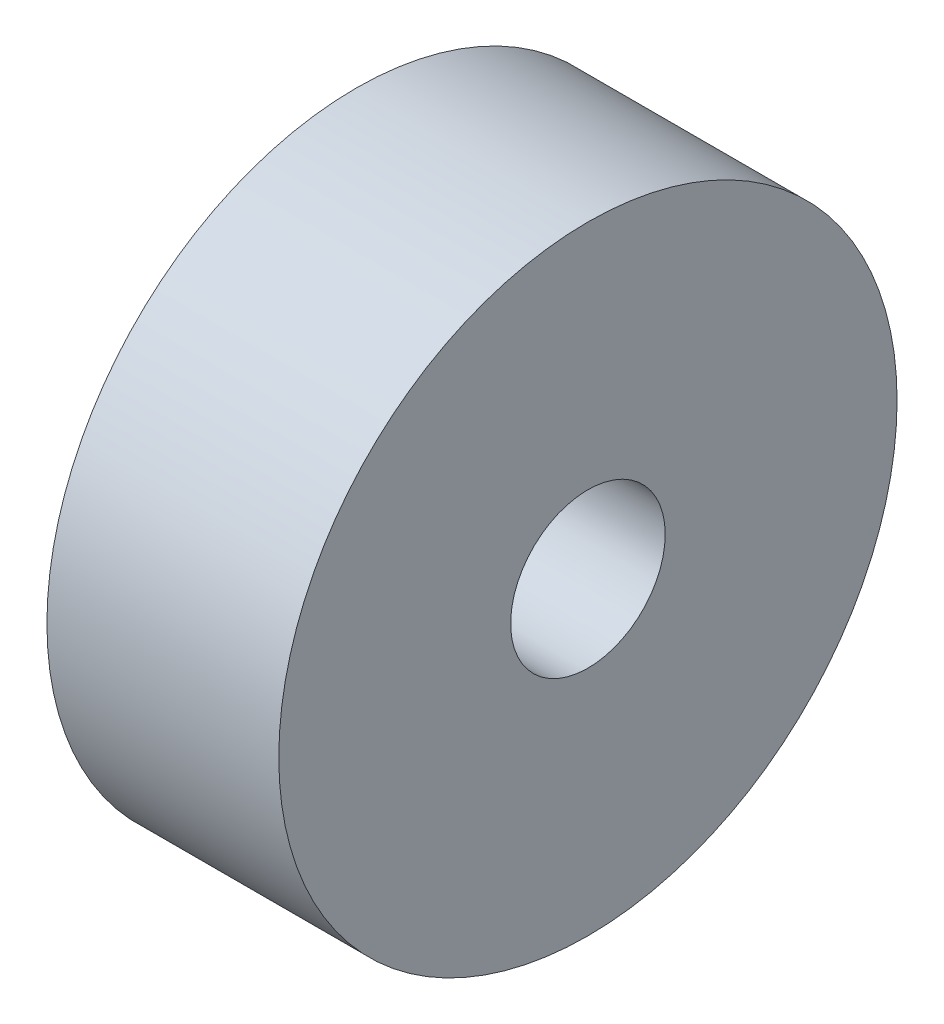
ISO-10303-21;
HEADER;
FILE_DESCRIPTION(('STEP AP214'),'2;1');
FILE_NAME('part.step','',(''),(''),'','','');
FILE_SCHEMA(('AUTOMOTIVE_DESIGN { 1 0 10303 214 1 1 1 1 }'));
ENDSEC;
DATA;
#1=APPLICATION_CONTEXT('core data for automotive mechanical design processes');
#2=APPLICATION_PROTOCOL_DEFINITION('international standard','automotive_design',2000,#1);
#3=PRODUCT_CONTEXT('',#1,'mechanical');
#4=PRODUCT('Part','Part','',(#3));
#5=PRODUCT_RELATED_PRODUCT_CATEGORY('part','',(#4));
#6=PRODUCT_DEFINITION_FORMATION('','',#4);
#7=PRODUCT_DEFINITION_CONTEXT('part definition',#1,'design');
#8=PRODUCT_DEFINITION('design','',#6,#7);
#9=PRODUCT_DEFINITION_SHAPE('','',#8);
#10=(LENGTH_UNIT() NAMED_UNIT(*) SI_UNIT(.MILLI.,.METRE.));
#11=(NAMED_UNIT(*) PLANE_ANGLE_UNIT() SI_UNIT($,.RADIAN.));
#12=(NAMED_UNIT(*) SI_UNIT($,.STERADIAN.) SOLID_ANGLE_UNIT());
#13=UNCERTAINTY_MEASURE_WITH_UNIT(LENGTH_MEASURE(1.E-05),#10,'distance_accuracy_value','');
#14=(GEOMETRIC_REPRESENTATION_CONTEXT(3) GLOBAL_UNCERTAINTY_ASSIGNED_CONTEXT((#13)) GLOBAL_UNIT_ASSIGNED_CONTEXT((#10,
#11,#12)) REPRESENTATION_CONTEXT('',''));
#15=CARTESIAN_POINT('',(0.,0.,0.));
#16=DIRECTION('',(0.,0.,1.));
#17=DIRECTION('',(1.,0.,0.));
#18=AXIS2_PLACEMENT_3D('',#15,#16,#17);
#19=CARTESIAN_POINT('',(76.2,0.,0.));
#20=DIRECTION('',(1.,0.,0.));
#21=DIRECTION('',(0.,0.,-1.));
#22=AXIS2_PLACEMENT_3D('',#19,#20,#21);
#23=PLANE('',#22);
#24=CARTESIAN_POINT('',(76.2,0.,0.));
#25=DIRECTION('',(1.,0.,0.));
#26=DIRECTION('',(0.,0.,-1.));
#27=AXIS2_PLACEMENT_3D('',#24,#25,#26);
#28=CIRCLE('',#27,101.6);
#29=CARTESIAN_POINT('',(76.2,0.,-101.6));
#30=VERTEX_POINT('',#29);
#31=EDGE_CURVE('E10',#30,#30,#28,.T.);
#32=ORIENTED_EDGE('',*,*,#31,.T.);
#33=EDGE_LOOP('',(#32));
#34=FACE_BOUND('',#33,.T.);
#35=CARTESIAN_POINT('',(76.2,0.,0.));
#36=DIRECTION('',(1.,0.,0.));
#37=DIRECTION('',(0.,0.,-1.));
#38=AXIS2_PLACEMENT_3D('',#35,#36,#37);
#39=CIRCLE('',#38,25.4);
#40=CARTESIAN_POINT('',(76.2,0.,-25.4));
#41=VERTEX_POINT('',#40);
#42=EDGE_CURVE('E42',#41,#41,#39,.T.);
#43=ORIENTED_EDGE('',*,*,#42,.F.);
#44=EDGE_LOOP('',(#43));
#45=FACE_BOUND('',#44,.T.);
#46=ADVANCED_FACE('F31',(#34,#45),#23,.T.);
#47=CARTESIAN_POINT('',(0.,0.,0.));
#48=DIRECTION('',(1.,0.,0.));
#49=DIRECTION('',(0.,0.,-1.));
#50=AXIS2_PLACEMENT_3D('',#47,#48,#49);
#51=PLANE('',#50);
#52=CARTESIAN_POINT('',(0.,0.,0.));
#53=DIRECTION('',(1.,0.,0.));
#54=DIRECTION('',(0.,0.,-1.));
#55=AXIS2_PLACEMENT_3D('',#52,#53,#54);
#56=CIRCLE('',#55,101.6);
#57=CARTESIAN_POINT('',(0.,0.,-101.6));
#58=VERTEX_POINT('',#57);
#59=EDGE_CURVE('E35',#58,#58,#56,.T.);
#60=ORIENTED_EDGE('',*,*,#59,.F.);
#61=EDGE_LOOP('',(#60));
#62=FACE_BOUND('',#61,.T.);
#63=CARTESIAN_POINT('',(0.,0.,0.));
#64=DIRECTION('',(1.,0.,0.));
#65=DIRECTION('',(0.,0.,-1.));
#66=AXIS2_PLACEMENT_3D('',#63,#64,#65);
#67=CIRCLE('',#66,25.4);
#68=CARTESIAN_POINT('',(0.,0.,-25.4));
#69=VERTEX_POINT('',#68);
#70=EDGE_CURVE('E44',#69,#69,#67,.T.);
#71=ORIENTED_EDGE('',*,*,#70,.T.);
#72=EDGE_LOOP('',(#71));
#73=FACE_BOUND('',#72,.T.);
#74=ADVANCED_FACE('F54',(#62,#73),#51,.F.);
#75=CARTESIAN_POINT('',(76.2,0.,0.));
#76=DIRECTION('',(-1.,0.,0.));
#77=DIRECTION('',(0.,0.,1.));
#78=AXIS2_PLACEMENT_3D('',#75,#76,#77);
#79=CYLINDRICAL_SURFACE('',#78,101.6);
#80=ORIENTED_EDGE('',*,*,#31,.F.);
#81=EDGE_LOOP('',(#80));
#82=FACE_BOUND('',#81,.T.);
#83=ORIENTED_EDGE('',*,*,#59,.T.);
#84=EDGE_LOOP('',(#83));
#85=FACE_BOUND('',#84,.T.);
#86=ADVANCED_FACE('F33',(#82,#85),#79,.T.);
#87=CARTESIAN_POINT('',(76.2,0.,0.));
#88=DIRECTION('',(-1.,0.,0.));
#89=DIRECTION('',(0.,0.,1.));
#90=AXIS2_PLACEMENT_3D('',#87,#88,#89);
#91=CYLINDRICAL_SURFACE('',#90,25.4);
#92=ORIENTED_EDGE('',*,*,#42,.T.);
#93=EDGE_LOOP('',(#92));
#94=FACE_BOUND('',#93,.T.);
#95=ORIENTED_EDGE('',*,*,#70,.F.);
#96=EDGE_LOOP('',(#95));
#97=FACE_BOUND('',#96,.T.);
#98=ADVANCED_FACE('F50',(#94,#97),#91,.F.);
#99=CLOSED_SHELL('',(#46,#74,#86,#98));
#100=MANIFOLD_SOLID_BREP('B2',#99);
#101=ADVANCED_BREP_SHAPE_REPRESENTATION('',(#18,#100),#14);
#102=SHAPE_DEFINITION_REPRESENTATION(#9,#101);
ENDSEC;
END-ISO-10303-21;
